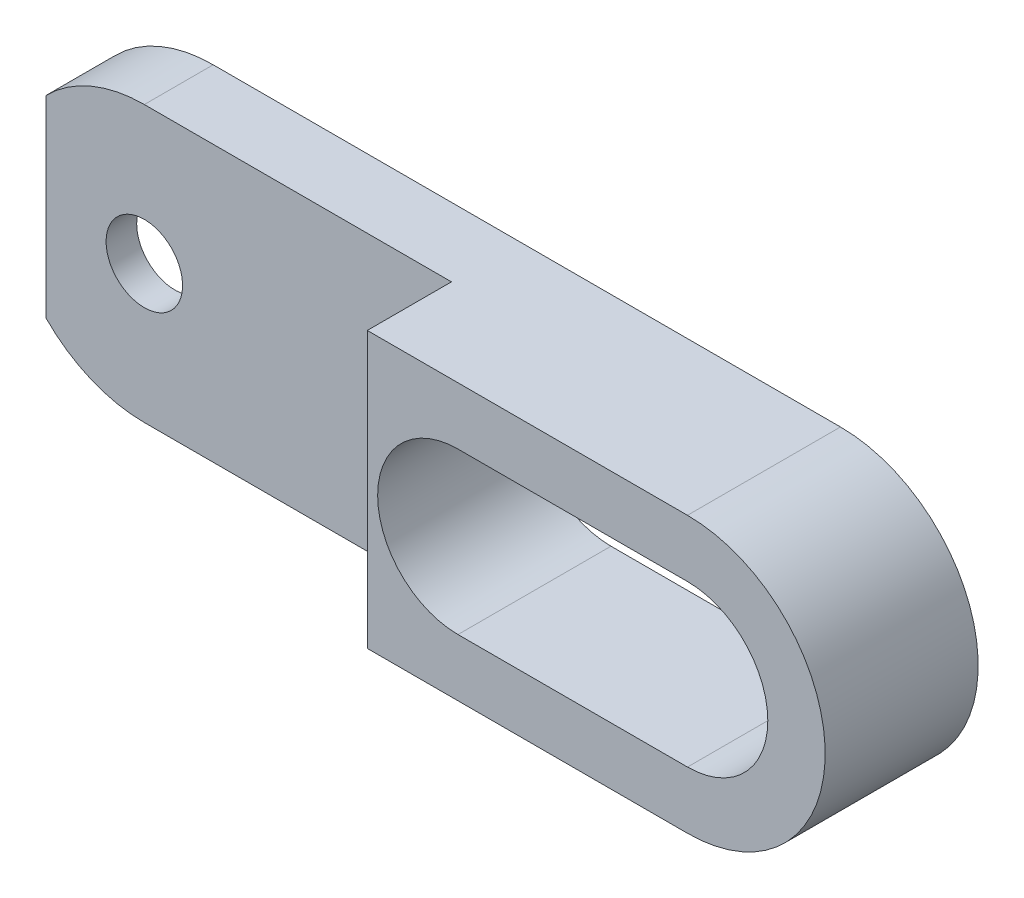
ISO-10303-21;
HEADER;
FILE_DESCRIPTION(('STEP AP214'),'2;1');
FILE_NAME('part.step','',(''),(''),'','','');
FILE_SCHEMA(('AUTOMOTIVE_DESIGN { 1 0 10303 214 1 1 1 1 }'));
ENDSEC;
DATA;
#1=APPLICATION_CONTEXT('core data for automotive mechanical design processes');
#2=APPLICATION_PROTOCOL_DEFINITION('international standard','automotive_design',2000,#1);
#3=PRODUCT_CONTEXT('',#1,'mechanical');
#4=PRODUCT('Part','Part','',(#3));
#5=PRODUCT_RELATED_PRODUCT_CATEGORY('part','',(#4));
#6=PRODUCT_DEFINITION_FORMATION('','',#4);
#7=PRODUCT_DEFINITION_CONTEXT('part definition',#1,'design');
#8=PRODUCT_DEFINITION('design','',#6,#7);
#9=PRODUCT_DEFINITION_SHAPE('','',#8);
#10=(LENGTH_UNIT() NAMED_UNIT(*) SI_UNIT(.MILLI.,.METRE.));
#11=(NAMED_UNIT(*) PLANE_ANGLE_UNIT() SI_UNIT($,.RADIAN.));
#12=(NAMED_UNIT(*) SI_UNIT($,.STERADIAN.) SOLID_ANGLE_UNIT());
#13=UNCERTAINTY_MEASURE_WITH_UNIT(LENGTH_MEASURE(1.E-05),#10,'distance_accuracy_value','');
#14=(GEOMETRIC_REPRESENTATION_CONTEXT(3) GLOBAL_UNCERTAINTY_ASSIGNED_CONTEXT((#13)) GLOBAL_UNIT_ASSIGNED_CONTEXT((#10,
#11,#12)) REPRESENTATION_CONTEXT('',''));
#15=CARTESIAN_POINT('',(0.,0.,0.));
#16=DIRECTION('',(0.,0.,1.));
#17=DIRECTION('',(1.,0.,0.));
#18=AXIS2_PLACEMENT_3D('',#15,#16,#17);
#19=CARTESIAN_POINT('',(20.073456929021,9.,2.5));
#20=DIRECTION('',(1.,0.,0.));
#21=DIRECTION('',(0.,1.,0.));
#22=AXIS2_PLACEMENT_3D('',#19,#20,#21);
#23=PLANE('',#22);
#24=DIRECTION('',(0.,-1.,0.));
#25=VECTOR('',#24,1.);
#26=CARTESIAN_POINT('',(20.073456929021,9.,4.5));
#27=LINE('',#26,#25);
#28=CARTESIAN_POINT('',(20.073456929021,9.,4.5));
#29=VERTEX_POINT('',#28);
#30=CARTESIAN_POINT('',(20.073456929021,-9.,4.5));
#31=VERTEX_POINT('',#30);
#32=EDGE_CURVE('E50',#29,#31,#27,.T.);
#33=ORIENTED_EDGE('',*,*,#32,.T.);
#34=DIRECTION('',(0.,0.,1.));
#35=VECTOR('',#34,1.);
#36=CARTESIAN_POINT('',(20.073456929021,-9.,2.5));
#37=LINE('',#36,#35);
#38=CARTESIAN_POINT('',(20.073456929021,-9.,10.));
#39=VERTEX_POINT('',#38);
#40=EDGE_CURVE('E210',#31,#39,#37,.T.);
#41=ORIENTED_EDGE('',*,*,#40,.T.);
#42=DIRECTION('',(0.,1.,0.));
#43=VECTOR('',#42,1.);
#44=CARTESIAN_POINT('',(20.073456929021,9.,10.));
#45=LINE('',#44,#43);
#46=CARTESIAN_POINT('',(20.073456929021,9.,10.));
#47=VERTEX_POINT('',#46);
#48=EDGE_CURVE('E205',#39,#47,#45,.T.);
#49=ORIENTED_EDGE('',*,*,#48,.T.);
#50=DIRECTION('',(0.,0.,1.));
#51=VECTOR('',#50,1.);
#52=CARTESIAN_POINT('',(20.073456929021,9.,2.5));
#53=LINE('',#52,#51);
#54=EDGE_CURVE('E209',#29,#47,#53,.T.);
#55=ORIENTED_EDGE('',*,*,#54,.F.);
#56=EDGE_LOOP('',(#33,#41,#49,#55));
#57=FACE_BOUND('',#56,.T.);
#58=ADVANCED_FACE('F35',(#57),#23,.F.);
#59=CARTESIAN_POINT('',(0.,0.,10.));
#60=DIRECTION('',(0.,0.,-1.));
#61=DIRECTION('',(-1.,0.,0.));
#62=AXIS2_PLACEMENT_3D('',#59,#60,#61);
#63=PLANE('',#62);
#64=DIRECTION('',(-1.,0.,0.));
#65=VECTOR('',#64,1.);
#66=CARTESIAN_POINT('',(0.,9.,10.));
#67=LINE('',#66,#65);
#68=CARTESIAN_POINT('',(41.,9.,10.));
#69=VERTEX_POINT('',#68);
#70=EDGE_CURVE('E262',#69,#47,#67,.T.);
#71=ORIENTED_EDGE('',*,*,#70,.T.);
#72=ORIENTED_EDGE('',*,*,#48,.F.);
#73=DIRECTION('',(1.,0.,0.));
#74=VECTOR('',#73,1.);
#75=CARTESIAN_POINT('',(0.,-9.,10.));
#76=LINE('',#75,#74);
#77=CARTESIAN_POINT('',(41.,-9.,10.));
#78=VERTEX_POINT('',#77);
#79=EDGE_CURVE('E257',#39,#78,#76,.T.);
#80=ORIENTED_EDGE('',*,*,#79,.T.);
#81=CARTESIAN_POINT('',(41.,0.,10.));
#82=DIRECTION('',(0.,0.,1.));
#83=DIRECTION('',(-1.,0.,0.));
#84=AXIS2_PLACEMENT_3D('',#81,#82,#83);
#85=CIRCLE('',#84,9.);
#86=EDGE_CURVE('E259',#78,#69,#85,.T.);
#87=ORIENTED_EDGE('',*,*,#86,.T.);
#88=EDGE_LOOP('',(#71,#72,#80,#87));
#89=FACE_BOUND('',#88,.T.);
#90=CARTESIAN_POINT('',(26.,0.,10.));
#91=DIRECTION('',(0.,0.,1.));
#92=DIRECTION('',(1.,0.,0.));
#93=AXIS2_PLACEMENT_3D('',#90,#91,#92);
#94=CIRCLE('',#93,5.25);
#95=CARTESIAN_POINT('',(26.,5.25,10.));
#96=VERTEX_POINT('',#95);
#97=CARTESIAN_POINT('',(26.,-5.25,10.));
#98=VERTEX_POINT('',#97);
#99=EDGE_CURVE('E228',#96,#98,#94,.T.);
#100=ORIENTED_EDGE('',*,*,#99,.F.);
#101=DIRECTION('',(-1.,0.,0.));
#102=VECTOR('',#101,1.);
#103=CARTESIAN_POINT('',(26.,5.25,10.));
#104=LINE('',#103,#102);
#105=CARTESIAN_POINT('',(41.,5.25,10.));
#106=VERTEX_POINT('',#105);
#107=EDGE_CURVE('E235',#106,#96,#104,.T.);
#108=ORIENTED_EDGE('',*,*,#107,.F.);
#109=CARTESIAN_POINT('',(41.,0.,10.));
#110=DIRECTION('',(0.,0.,1.));
#111=DIRECTION('',(-1.,0.,0.));
#112=AXIS2_PLACEMENT_3D('',#109,#110,#111);
#113=CIRCLE('',#112,5.25);
#114=CARTESIAN_POINT('',(41.,-5.25,10.));
#115=VERTEX_POINT('',#114);
#116=EDGE_CURVE('E233',#115,#106,#113,.T.);
#117=ORIENTED_EDGE('',*,*,#116,.F.);
#118=DIRECTION('',(1.,0.,0.));
#119=VECTOR('',#118,1.);
#120=CARTESIAN_POINT('',(26.,-5.25,10.));
#121=LINE('',#120,#119);
#122=EDGE_CURVE('E230',#98,#115,#121,.T.);
#123=ORIENTED_EDGE('',*,*,#122,.F.);
#124=EDGE_LOOP('',(#100,#108,#117,#123));
#125=FACE_BOUND('',#124,.T.);
#126=ADVANCED_FACE('F382',(#89,#125),#63,.F.);
#127=CARTESIAN_POINT('',(0.,0.,0.));
#128=DIRECTION('',(0.,0.,-1.));
#129=DIRECTION('',(-1.,0.,0.));
#130=AXIS2_PLACEMENT_3D('',#127,#128,#129);
#131=PLANE('',#130);
#132=CARTESIAN_POINT('',(0.,0.,0.));
#133=DIRECTION('',(0.,0.,1.));
#134=DIRECTION('',(-1.,0.,0.));
#135=AXIS2_PLACEMENT_3D('',#132,#133,#134);
#136=CIRCLE('',#135,9.);
#137=CARTESIAN_POINT('',(0.,9.,0.));
#138=VERTEX_POINT('',#137);
#139=CARTESIAN_POINT('',(-6.42654307097901,6.30075742723457,0.));
#140=VERTEX_POINT('',#139);
#141=EDGE_CURVE('E256',#138,#140,#136,.T.);
#142=ORIENTED_EDGE('',*,*,#141,.F.);
#143=DIRECTION('',(-1.,0.,0.));
#144=VECTOR('',#143,1.);
#145=CARTESIAN_POINT('',(0.,9.,0.));
#146=LINE('',#145,#144);
#147=CARTESIAN_POINT('',(41.,9.,0.));
#148=VERTEX_POINT('',#147);
#149=EDGE_CURVE('E260',#148,#138,#146,.T.);
#150=ORIENTED_EDGE('',*,*,#149,.F.);
#151=CARTESIAN_POINT('',(41.,0.,0.));
#152=DIRECTION('',(0.,0.,1.));
#153=DIRECTION('',(-1.,0.,0.));
#154=AXIS2_PLACEMENT_3D('',#151,#152,#153);
#155=CIRCLE('',#154,9.);
#156=CARTESIAN_POINT('',(41.,-9.,0.));
#157=VERTEX_POINT('',#156);
#158=EDGE_CURVE('E293',#157,#148,#155,.T.);
#159=ORIENTED_EDGE('',*,*,#158,.F.);
#160=DIRECTION('',(1.,0.,0.));
#161=VECTOR('',#160,1.);
#162=CARTESIAN_POINT('',(0.,-9.,0.));
#163=LINE('',#162,#161);
#164=CARTESIAN_POINT('',(0.,-9.,0.));
#165=VERTEX_POINT('',#164);
#166=EDGE_CURVE('E291',#165,#157,#163,.T.);
#167=ORIENTED_EDGE('',*,*,#166,.F.);
#168=CARTESIAN_POINT('',(0.,0.,0.));
#169=DIRECTION('',(0.,0.,1.));
#170=DIRECTION('',(1.,0.,0.));
#171=AXIS2_PLACEMENT_3D('',#168,#169,#170);
#172=CIRCLE('',#171,9.);
#173=CARTESIAN_POINT('',(-6.42654307097901,-6.30075742723457,0.));
#174=VERTEX_POINT('',#173);
#175=EDGE_CURVE('E289',#174,#165,#172,.T.);
#176=ORIENTED_EDGE('',*,*,#175,.F.);
#177=DIRECTION('',(-0.707106781186548,-0.707106781186548,0.));
#178=VECTOR('',#177,1.);
#179=CARTESIAN_POINT('',(-4.37578564374445,-4.25,0.));
#180=LINE('',#179,#178);
#181=CARTESIAN_POINT('',(-4.37578564374444,-4.25,0.));
#182=VERTEX_POINT('',#181);
#183=EDGE_CURVE('E286',#182,#174,#180,.T.);
#184=ORIENTED_EDGE('',*,*,#183,.F.);
#185=CARTESIAN_POINT('',(0.,0.,0.));
#186=DIRECTION('',(0.,0.,-1.));
#187=DIRECTION('',(-1.,0.,0.));
#188=AXIS2_PLACEMENT_3D('',#185,#186,#187);
#189=CIRCLE('',#188,6.1);
#190=CARTESIAN_POINT('',(4.37578564374445,-4.25,0.));
#191=VERTEX_POINT('',#190);
#192=EDGE_CURVE('E283',#191,#182,#189,.T.);
#193=ORIENTED_EDGE('',*,*,#192,.F.);
#194=DIRECTION('',(-0.993627549913592,-0.112713317991759,0.));
#195=VECTOR('',#194,1.);
#196=CARTESIAN_POINT('',(17.3155972903769,-2.78215713975806,0.));
#197=LINE('',#196,#195);
#198=CARTESIAN_POINT('',(17.3155972903769,-2.78215713975806,0.));
#199=VERTEX_POINT('',#198);
#200=EDGE_CURVE('E280',#199,#191,#197,.T.);
#201=ORIENTED_EDGE('',*,*,#200,.F.);
#202=CARTESIAN_POINT('',(17.,0.,0.));
#203=DIRECTION('',(0.,0.,-1.));
#204=DIRECTION('',(1.,0.,0.));
#205=AXIS2_PLACEMENT_3D('',#202,#203,#204);
#206=CIRCLE('',#205,2.8);
#207=CARTESIAN_POINT('',(17.3155972903769,2.78215713975806,0.));
#208=VERTEX_POINT('',#207);
#209=EDGE_CURVE('E277',#208,#199,#206,.T.);
#210=ORIENTED_EDGE('',*,*,#209,.F.);
#211=DIRECTION('',(0.993627549913592,-0.112713317991759,0.));
#212=VECTOR('',#211,1.);
#213=CARTESIAN_POINT('',(4.37578564374445,4.25,0.));
#214=LINE('',#213,#212);
#215=CARTESIAN_POINT('',(4.37578564374445,4.25,0.));
#216=VERTEX_POINT('',#215);
#217=EDGE_CURVE('E274',#216,#208,#214,.T.);
#218=ORIENTED_EDGE('',*,*,#217,.F.);
#219=CARTESIAN_POINT('',(0.,0.,0.));
#220=DIRECTION('',(0.,0.,-1.));
#221=DIRECTION('',(1.,0.,0.));
#222=AXIS2_PLACEMENT_3D('',#219,#220,#221);
#223=CIRCLE('',#222,6.1);
#224=CARTESIAN_POINT('',(-4.37578564374445,4.25,0.));
#225=VERTEX_POINT('',#224);
#226=EDGE_CURVE('E271',#225,#216,#223,.T.);
#227=ORIENTED_EDGE('',*,*,#226,.F.);
#228=DIRECTION('',(0.707106781186548,-0.707106781186548,0.));
#229=VECTOR('',#228,1.);
#230=CARTESIAN_POINT('',(-4.37578564374445,4.25,0.));
#231=LINE('',#230,#229);
#232=EDGE_CURVE('E268',#140,#225,#231,.T.);
#233=ORIENTED_EDGE('',*,*,#232,.F.);
#234=EDGE_LOOP('',(#142,#150,#159,#167,#176,#184,#193,#201,#210,#218,#227,#233));
#235=FACE_BOUND('',#234,.T.);
#236=DIRECTION('',(-1.,0.,0.));
#237=VECTOR('',#236,1.);
#238=CARTESIAN_POINT('',(26.,5.25,0.));
#239=LINE('',#238,#237);
#240=CARTESIAN_POINT('',(41.,5.25,0.));
#241=VERTEX_POINT('',#240);
#242=CARTESIAN_POINT('',(26.,5.25,0.));
#243=VERTEX_POINT('',#242);
#244=EDGE_CURVE('E231',#241,#243,#239,.T.);
#245=ORIENTED_EDGE('',*,*,#244,.T.);
#246=CARTESIAN_POINT('',(26.,0.,0.));
#247=DIRECTION('',(0.,0.,1.));
#248=DIRECTION('',(1.,0.,0.));
#249=AXIS2_PLACEMENT_3D('',#246,#247,#248);
#250=CIRCLE('',#249,5.25);
#251=CARTESIAN_POINT('',(26.,-5.25,0.));
#252=VERTEX_POINT('',#251);
#253=EDGE_CURVE('E227',#243,#252,#250,.T.);
#254=ORIENTED_EDGE('',*,*,#253,.T.);
#255=DIRECTION('',(1.,0.,0.));
#256=VECTOR('',#255,1.);
#257=CARTESIAN_POINT('',(26.,-5.25,0.));
#258=LINE('',#257,#256);
#259=CARTESIAN_POINT('',(41.,-5.25,0.));
#260=VERTEX_POINT('',#259);
#261=EDGE_CURVE('E240',#252,#260,#258,.T.);
#262=ORIENTED_EDGE('',*,*,#261,.T.);
#263=CARTESIAN_POINT('',(41.,0.,0.));
#264=DIRECTION('',(0.,0.,1.));
#265=DIRECTION('',(-1.,0.,0.));
#266=AXIS2_PLACEMENT_3D('',#263,#264,#265);
#267=CIRCLE('',#266,5.25);
#268=EDGE_CURVE('E243',#260,#241,#267,.T.);
#269=ORIENTED_EDGE('',*,*,#268,.T.);
#270=EDGE_LOOP('',(#245,#254,#262,#269));
#271=FACE_BOUND('',#270,.T.);
#272=ADVANCED_FACE('F330',(#235,#271),#131,.T.);
#273=CARTESIAN_POINT('',(0.,0.,10.));
#274=DIRECTION('',(0.,0.,-1.));
#275=DIRECTION('',(-1.,0.,0.));
#276=AXIS2_PLACEMENT_3D('',#273,#274,#275);
#277=CYLINDRICAL_SURFACE('',#276,9.);
#278=DIRECTION('',(0.,0.,-1.));
#279=VECTOR('',#278,1.);
#280=CARTESIAN_POINT('',(-6.42654307097901,6.30075742723457,10.));
#281=LINE('',#280,#279);
#282=CARTESIAN_POINT('',(-6.42654307097902,6.30075742723457,2.5));
#283=VERTEX_POINT('',#282);
#284=EDGE_CURVE('E11',#283,#140,#281,.T.);
#285=ORIENTED_EDGE('',*,*,#284,.F.);
#286=DIRECTION('',(0.,0.,-1.));
#287=VECTOR('',#286,1.);
#288=CARTESIAN_POINT('',(-6.42654307097902,6.30075742723457,4.5));
#289=LINE('',#288,#287);
#290=CARTESIAN_POINT('',(-6.42654307097902,6.30075742723457,4.5));
#291=VERTEX_POINT('',#290);
#292=EDGE_CURVE('E175',#291,#283,#289,.T.);
#293=ORIENTED_EDGE('',*,*,#292,.F.);
#294=CARTESIAN_POINT('',(0.,0.,4.5));
#295=DIRECTION('',(0.,0.,-1.));
#296=DIRECTION('',(-1.,0.,0.));
#297=AXIS2_PLACEMENT_3D('',#294,#295,#296);
#298=CIRCLE('',#297,9.);
#299=CARTESIAN_POINT('',(0.,9.,4.5));
#300=VERTEX_POINT('',#299);
#301=EDGE_CURVE('E187',#291,#300,#298,.T.);
#302=ORIENTED_EDGE('',*,*,#301,.T.);
#303=DIRECTION('',(0.,0.,-1.));
#304=VECTOR('',#303,1.);
#305=CARTESIAN_POINT('',(0.,9.,10.));
#306=LINE('',#305,#304);
#307=EDGE_CURVE('E265',#300,#138,#306,.T.);
#308=ORIENTED_EDGE('',*,*,#307,.T.);
#309=ORIENTED_EDGE('',*,*,#141,.T.);
#310=EDGE_LOOP('',(#285,#293,#302,#308,#309));
#311=FACE_BOUND('',#310,.T.);
#312=ADVANCED_FACE('F37',(#311),#277,.T.);
#313=CARTESIAN_POINT('',(-4.37578564374445,4.25,10.));
#314=DIRECTION('',(0.707106781186548,0.707106781186548,0.));
#315=DIRECTION('',(-0.707106781186548,0.707106781186548,0.));
#316=AXIS2_PLACEMENT_3D('',#313,#314,#315);
#317=PLANE('',#316);
#318=DIRECTION('',(0.,0.,-1.));
#319=VECTOR('',#318,1.);
#320=CARTESIAN_POINT('',(-4.37578564374445,4.25,10.));
#321=LINE('',#320,#319);
#322=CARTESIAN_POINT('',(-4.37578564374445,4.25,2.5));
#323=VERTEX_POINT('',#322);
#324=EDGE_CURVE('E43',#323,#225,#321,.T.);
#325=ORIENTED_EDGE('',*,*,#324,.F.);
#326=DIRECTION('',(-0.707106781186548,0.707106781186548,0.));
#327=VECTOR('',#326,1.);
#328=CARTESIAN_POINT('',(-4.37578564374445,4.25,2.5));
#329=LINE('',#328,#327);
#330=EDGE_CURVE('E225',#323,#283,#329,.T.);
#331=ORIENTED_EDGE('',*,*,#330,.T.);
#332=ORIENTED_EDGE('',*,*,#284,.T.);
#333=ORIENTED_EDGE('',*,*,#232,.T.);
#334=EDGE_LOOP('',(#325,#331,#332,#333));
#335=FACE_BOUND('',#334,.T.);
#336=ADVANCED_FACE('F326',(#335),#317,.F.);
#337=CARTESIAN_POINT('',(0.,0.,10.));
#338=DIRECTION('',(0.,0.,-1.));
#339=DIRECTION('',(-1.,0.,0.));
#340=AXIS2_PLACEMENT_3D('',#337,#338,#339);
#341=CYLINDRICAL_SURFACE('',#340,6.1);
#342=DIRECTION('',(0.,0.,-1.));
#343=VECTOR('',#342,1.);
#344=CARTESIAN_POINT('',(4.37578564374445,4.25,10.));
#345=LINE('',#344,#343);
#346=CARTESIAN_POINT('',(4.37578564374445,4.25,2.5));
#347=VERTEX_POINT('',#346);
#348=EDGE_CURVE('E315',#347,#216,#345,.T.);
#349=ORIENTED_EDGE('',*,*,#348,.F.);
#350=CARTESIAN_POINT('',(0.,0.,2.5));
#351=DIRECTION('',(0.,0.,-1.));
#352=DIRECTION('',(-1.,0.,0.));
#353=AXIS2_PLACEMENT_3D('',#350,#351,#352);
#354=CIRCLE('',#353,6.1);
#355=EDGE_CURVE('E223',#347,#323,#354,.F.);
#356=ORIENTED_EDGE('',*,*,#355,.T.);
#357=ORIENTED_EDGE('',*,*,#324,.T.);
#358=ORIENTED_EDGE('',*,*,#226,.T.);
#359=EDGE_LOOP('',(#349,#356,#357,#358));
#360=FACE_BOUND('',#359,.T.);
#361=ADVANCED_FACE('F319',(#360),#341,.F.);
#362=CARTESIAN_POINT('',(4.37578564374445,4.25,10.));
#363=DIRECTION('',(0.112713317991759,0.993627549913592,0.));
#364=DIRECTION('',(-0.993627549913592,0.112713317991759,0.));
#365=AXIS2_PLACEMENT_3D('',#362,#363,#364);
#366=PLANE('',#365);
#367=DIRECTION('',(0.,0.,-1.));
#368=VECTOR('',#367,1.);
#369=CARTESIAN_POINT('',(17.3155972903769,2.78215713975806,10.));
#370=LINE('',#369,#368);
#371=CARTESIAN_POINT('',(17.3155972903769,2.78215713975806,2.5));
#372=VERTEX_POINT('',#371);
#373=EDGE_CURVE('E313',#372,#208,#370,.T.);
#374=ORIENTED_EDGE('',*,*,#373,.F.);
#375=DIRECTION('',(-0.993627549913592,0.112713317991759,0.));
#376=VECTOR('',#375,1.);
#377=CARTESIAN_POINT('',(4.37578564374445,4.25,2.5));
#378=LINE('',#377,#376);
#379=EDGE_CURVE('E221',#372,#347,#378,.T.);
#380=ORIENTED_EDGE('',*,*,#379,.T.);
#381=ORIENTED_EDGE('',*,*,#348,.T.);
#382=ORIENTED_EDGE('',*,*,#217,.T.);
#383=EDGE_LOOP('',(#374,#380,#381,#382));
#384=FACE_BOUND('',#383,.T.);
#385=ADVANCED_FACE('F336',(#384),#366,.F.);
#386=CARTESIAN_POINT('',(17.,0.,10.));
#387=DIRECTION('',(0.,0.,-1.));
#388=DIRECTION('',(-1.,0.,0.));
#389=AXIS2_PLACEMENT_3D('',#386,#387,#388);
#390=CYLINDRICAL_SURFACE('',#389,2.8);
#391=DIRECTION('',(0.,0.,-1.));
#392=VECTOR('',#391,1.);
#393=CARTESIAN_POINT('',(17.3155972903769,-2.78215713975806,10.));
#394=LINE('',#393,#392);
#395=CARTESIAN_POINT('',(17.3155972903769,-2.78215713975806,2.5));
#396=VERTEX_POINT('',#395);
#397=EDGE_CURVE('E311',#396,#199,#394,.T.);
#398=ORIENTED_EDGE('',*,*,#397,.F.);
#399=CARTESIAN_POINT('',(17.,0.,2.5));
#400=DIRECTION('',(0.,0.,-1.));
#401=DIRECTION('',(-1.,0.,0.));
#402=AXIS2_PLACEMENT_3D('',#399,#400,#401);
#403=CIRCLE('',#402,2.8);
#404=EDGE_CURVE('E219',#396,#372,#403,.F.);
#405=ORIENTED_EDGE('',*,*,#404,.T.);
#406=ORIENTED_EDGE('',*,*,#373,.T.);
#407=ORIENTED_EDGE('',*,*,#209,.T.);
#408=EDGE_LOOP('',(#398,#405,#406,#407));
#409=FACE_BOUND('',#408,.T.);
#410=ADVANCED_FACE('F372',(#409),#390,.F.);
#411=CARTESIAN_POINT('',(17.3155972903769,-2.78215713975806,10.));
#412=DIRECTION('',(0.112713317991759,-0.993627549913592,0.));
#413=DIRECTION('',(0.993627549913592,0.112713317991759,0.));
#414=AXIS2_PLACEMENT_3D('',#411,#412,#413);
#415=PLANE('',#414);
#416=DIRECTION('',(0.,0.,-1.));
#417=VECTOR('',#416,1.);
#418=CARTESIAN_POINT('',(4.37578564374445,-4.25,10.));
#419=LINE('',#418,#417);
#420=CARTESIAN_POINT('',(4.37578564374445,-4.25,2.5));
#421=VERTEX_POINT('',#420);
#422=EDGE_CURVE('E309',#421,#191,#419,.T.);
#423=ORIENTED_EDGE('',*,*,#422,.F.);
#424=DIRECTION('',(0.993627549913592,0.112713317991759,0.));
#425=VECTOR('',#424,1.);
#426=CARTESIAN_POINT('',(17.3155972903769,-2.78215713975806,2.5));
#427=LINE('',#426,#425);
#428=EDGE_CURVE('E217',#421,#396,#427,.T.);
#429=ORIENTED_EDGE('',*,*,#428,.T.);
#430=ORIENTED_EDGE('',*,*,#397,.T.);
#431=ORIENTED_EDGE('',*,*,#200,.T.);
#432=EDGE_LOOP('',(#423,#429,#430,#431));
#433=FACE_BOUND('',#432,.T.);
#434=ADVANCED_FACE('F368',(#433),#415,.F.);
#435=CARTESIAN_POINT('',(0.,0.,10.));
#436=DIRECTION('',(0.,0.,-1.));
#437=DIRECTION('',(-1.,0.,0.));
#438=AXIS2_PLACEMENT_3D('',#435,#436,#437);
#439=CYLINDRICAL_SURFACE('',#438,6.1);
#440=DIRECTION('',(0.,0.,-1.));
#441=VECTOR('',#440,1.);
#442=CARTESIAN_POINT('',(-4.37578564374444,-4.25,10.));
#443=LINE('',#442,#441);
#444=CARTESIAN_POINT('',(-4.37578564374445,-4.25,2.5));
#445=VERTEX_POINT('',#444);
#446=EDGE_CURVE('E307',#445,#182,#443,.T.);
#447=ORIENTED_EDGE('',*,*,#446,.F.);
#448=CARTESIAN_POINT('',(0.,0.,2.5));
#449=DIRECTION('',(0.,0.,-1.));
#450=DIRECTION('',(-1.,0.,0.));
#451=AXIS2_PLACEMENT_3D('',#448,#449,#450);
#452=CIRCLE('',#451,6.1);
#453=EDGE_CURVE('E215',#445,#421,#452,.F.);
#454=ORIENTED_EDGE('',*,*,#453,.T.);
#455=ORIENTED_EDGE('',*,*,#422,.T.);
#456=ORIENTED_EDGE('',*,*,#192,.T.);
#457=EDGE_LOOP('',(#447,#454,#455,#456));
#458=FACE_BOUND('',#457,.T.);
#459=ADVANCED_FACE('F365',(#458),#439,.F.);
#460=CARTESIAN_POINT('',(-4.37578564374445,-4.25,10.));
#461=DIRECTION('',(0.707106781186548,-0.707106781186548,0.));
#462=DIRECTION('',(0.707106781186548,0.707106781186548,0.));
#463=AXIS2_PLACEMENT_3D('',#460,#461,#462);
#464=PLANE('',#463);
#465=DIRECTION('',(0.,0.,-1.));
#466=VECTOR('',#465,1.);
#467=CARTESIAN_POINT('',(-6.42654307097901,-6.30075742723457,10.));
#468=LINE('',#467,#466);
#469=CARTESIAN_POINT('',(-6.42654307097902,-6.30075742723457,2.5));
#470=VERTEX_POINT('',#469);
#471=EDGE_CURVE('E305',#470,#174,#468,.T.);
#472=ORIENTED_EDGE('',*,*,#471,.F.);
#473=DIRECTION('',(0.707106781186548,0.707106781186548,0.));
#474=VECTOR('',#473,1.);
#475=CARTESIAN_POINT('',(-4.37578564374445,-4.25,2.5));
#476=LINE('',#475,#474);
#477=EDGE_CURVE('E212',#470,#445,#476,.T.);
#478=ORIENTED_EDGE('',*,*,#477,.T.);
#479=ORIENTED_EDGE('',*,*,#446,.T.);
#480=ORIENTED_EDGE('',*,*,#183,.T.);
#481=EDGE_LOOP('',(#472,#478,#479,#480));
#482=FACE_BOUND('',#481,.T.);
#483=ADVANCED_FACE('F361',(#482),#464,.F.);
#484=CARTESIAN_POINT('',(0.,0.,10.));
#485=DIRECTION('',(0.,0.,-1.));
#486=DIRECTION('',(-1.,0.,0.));
#487=AXIS2_PLACEMENT_3D('',#484,#485,#486);
#488=CYLINDRICAL_SURFACE('',#487,9.);
#489=DIRECTION('',(0.,0.,-1.));
#490=VECTOR('',#489,1.);
#491=CARTESIAN_POINT('',(0.,-9.,10.));
#492=LINE('',#491,#490);
#493=CARTESIAN_POINT('',(0.,-9.,4.5));
#494=VERTEX_POINT('',#493);
#495=EDGE_CURVE('E191',#494,#165,#492,.T.);
#496=ORIENTED_EDGE('',*,*,#495,.F.);
#497=CARTESIAN_POINT('',(0.,0.,4.5));
#498=DIRECTION('',(0.,0.,-1.));
#499=DIRECTION('',(-1.,0.,0.));
#500=AXIS2_PLACEMENT_3D('',#497,#498,#499);
#501=CIRCLE('',#500,9.);
#502=CARTESIAN_POINT('',(-6.42654307097901,-6.30075742723457,4.5));
#503=VERTEX_POINT('',#502);
#504=EDGE_CURVE('E183',#494,#503,#501,.T.);
#505=ORIENTED_EDGE('',*,*,#504,.T.);
#506=DIRECTION('',(0.,0.,-1.));
#507=VECTOR('',#506,1.);
#508=CARTESIAN_POINT('',(-6.42654307097901,-6.30075742723457,4.5));
#509=LINE('',#508,#507);
#510=EDGE_CURVE('E166',#503,#470,#509,.T.);
#511=ORIENTED_EDGE('',*,*,#510,.T.);
#512=ORIENTED_EDGE('',*,*,#471,.T.);
#513=ORIENTED_EDGE('',*,*,#175,.T.);
#514=EDGE_LOOP('',(#496,#505,#511,#512,#513));
#515=FACE_BOUND('',#514,.T.);
#516=ADVANCED_FACE('F189',(#515),#488,.T.);
#517=CARTESIAN_POINT('',(0.,-9.,10.));
#518=DIRECTION('',(0.,1.,0.));
#519=DIRECTION('',(-1.,0.,0.));
#520=AXIS2_PLACEMENT_3D('',#517,#518,#519);
#521=PLANE('',#520);
#522=ORIENTED_EDGE('',*,*,#79,.F.);
#523=ORIENTED_EDGE('',*,*,#40,.F.);
#524=DIRECTION('',(-1.,0.,0.));
#525=VECTOR('',#524,1.);
#526=CARTESIAN_POINT('',(0.,-9.,4.5));
#527=LINE('',#526,#525);
#528=EDGE_CURVE('E176',#31,#494,#527,.T.);
#529=ORIENTED_EDGE('',*,*,#528,.T.);
#530=ORIENTED_EDGE('',*,*,#495,.T.);
#531=ORIENTED_EDGE('',*,*,#166,.T.);
#532=DIRECTION('',(0.,0.,-1.));
#533=VECTOR('',#532,1.);
#534=CARTESIAN_POINT('',(41.,-9.,10.));
#535=LINE('',#534,#533);
#536=EDGE_CURVE('E301',#78,#157,#535,.T.);
#537=ORIENTED_EDGE('',*,*,#536,.F.);
#538=EDGE_LOOP('',(#522,#523,#529,#530,#531,#537));
#539=FACE_BOUND('',#538,.T.);
#540=ADVANCED_FACE('F356',(#539),#521,.F.);
#541=CARTESIAN_POINT('',(41.,0.,10.));
#542=DIRECTION('',(0.,0.,-1.));
#543=DIRECTION('',(-1.,0.,0.));
#544=AXIS2_PLACEMENT_3D('',#541,#542,#543);
#545=CYLINDRICAL_SURFACE('',#544,9.);
#546=ORIENTED_EDGE('',*,*,#158,.T.);
#547=DIRECTION('',(0.,0.,-1.));
#548=VECTOR('',#547,1.);
#549=CARTESIAN_POINT('',(41.,9.,10.));
#550=LINE('',#549,#548);
#551=EDGE_CURVE('E298',#69,#148,#550,.T.);
#552=ORIENTED_EDGE('',*,*,#551,.F.);
#553=ORIENTED_EDGE('',*,*,#86,.F.);
#554=ORIENTED_EDGE('',*,*,#536,.T.);
#555=EDGE_LOOP('',(#546,#552,#553,#554));
#556=FACE_BOUND('',#555,.T.);
#557=ADVANCED_FACE('F352',(#556),#545,.T.);
#558=CARTESIAN_POINT('',(0.,9.,10.));
#559=DIRECTION('',(0.,-1.,0.));
#560=DIRECTION('',(1.,0.,0.));
#561=AXIS2_PLACEMENT_3D('',#558,#559,#560);
#562=PLANE('',#561);
#563=ORIENTED_EDGE('',*,*,#307,.F.);
#564=DIRECTION('',(1.,0.,0.));
#565=VECTOR('',#564,1.);
#566=CARTESIAN_POINT('',(0.,9.,4.5));
#567=LINE('',#566,#565);
#568=EDGE_CURVE('E200',#300,#29,#567,.T.);
#569=ORIENTED_EDGE('',*,*,#568,.T.);
#570=ORIENTED_EDGE('',*,*,#54,.T.);
#571=ORIENTED_EDGE('',*,*,#70,.F.);
#572=ORIENTED_EDGE('',*,*,#551,.T.);
#573=ORIENTED_EDGE('',*,*,#149,.T.);
#574=EDGE_LOOP('',(#563,#569,#570,#571,#572,#573));
#575=FACE_BOUND('',#574,.T.);
#576=ADVANCED_FACE('F347',(#575),#562,.F.);
#577=CARTESIAN_POINT('',(26.,0.,10.));
#578=DIRECTION('',(0.,0.,-1.));
#579=DIRECTION('',(-1.,0.,0.));
#580=AXIS2_PLACEMENT_3D('',#577,#578,#579);
#581=CYLINDRICAL_SURFACE('',#580,5.25);
#582=ORIENTED_EDGE('',*,*,#253,.F.);
#583=DIRECTION('',(0.,0.,-1.));
#584=VECTOR('',#583,1.);
#585=CARTESIAN_POINT('',(26.,5.25,10.));
#586=LINE('',#585,#584);
#587=EDGE_CURVE('E237',#96,#243,#586,.T.);
#588=ORIENTED_EDGE('',*,*,#587,.F.);
#589=ORIENTED_EDGE('',*,*,#99,.T.);
#590=DIRECTION('',(0.,0.,-1.));
#591=VECTOR('',#590,1.);
#592=CARTESIAN_POINT('',(26.,-5.25,10.));
#593=LINE('',#592,#591);
#594=EDGE_CURVE('E253',#98,#252,#593,.T.);
#595=ORIENTED_EDGE('',*,*,#594,.T.);
#596=EDGE_LOOP('',(#582,#588,#589,#595));
#597=FACE_BOUND('',#596,.T.);
#598=ADVANCED_FACE('F402',(#597),#581,.F.);
#599=CARTESIAN_POINT('',(26.,-5.25,10.));
#600=DIRECTION('',(0.,1.,0.));
#601=DIRECTION('',(0.,0.,1.));
#602=AXIS2_PLACEMENT_3D('',#599,#600,#601);
#603=PLANE('',#602);
#604=ORIENTED_EDGE('',*,*,#261,.F.);
#605=ORIENTED_EDGE('',*,*,#594,.F.);
#606=ORIENTED_EDGE('',*,*,#122,.T.);
#607=DIRECTION('',(0.,0.,-1.));
#608=VECTOR('',#607,1.);
#609=CARTESIAN_POINT('',(41.,-5.25,10.));
#610=LINE('',#609,#608);
#611=EDGE_CURVE('E251',#115,#260,#610,.T.);
#612=ORIENTED_EDGE('',*,*,#611,.T.);
#613=EDGE_LOOP('',(#604,#605,#606,#612));
#614=FACE_BOUND('',#613,.T.);
#615=ADVANCED_FACE('F398',(#614),#603,.T.);
#616=CARTESIAN_POINT('',(41.,0.,10.));
#617=DIRECTION('',(0.,0.,-1.));
#618=DIRECTION('',(-1.,0.,0.));
#619=AXIS2_PLACEMENT_3D('',#616,#617,#618);
#620=CYLINDRICAL_SURFACE('',#619,5.25);
#621=ORIENTED_EDGE('',*,*,#268,.F.);
#622=ORIENTED_EDGE('',*,*,#611,.F.);
#623=ORIENTED_EDGE('',*,*,#116,.T.);
#624=DIRECTION('',(0.,0.,-1.));
#625=VECTOR('',#624,1.);
#626=CARTESIAN_POINT('',(41.,5.25,10.));
#627=LINE('',#626,#625);
#628=EDGE_CURVE('E58',#106,#241,#627,.T.);
#629=ORIENTED_EDGE('',*,*,#628,.T.);
#630=EDGE_LOOP('',(#621,#622,#623,#629));
#631=FACE_BOUND('',#630,.T.);
#632=ADVANCED_FACE('F395',(#631),#620,.F.);
#633=CARTESIAN_POINT('',(26.,5.25,10.));
#634=DIRECTION('',(0.,-1.,0.));
#635=DIRECTION('',(0.,0.,-1.));
#636=AXIS2_PLACEMENT_3D('',#633,#634,#635);
#637=PLANE('',#636);
#638=ORIENTED_EDGE('',*,*,#244,.F.);
#639=ORIENTED_EDGE('',*,*,#628,.F.);
#640=ORIENTED_EDGE('',*,*,#107,.T.);
#641=ORIENTED_EDGE('',*,*,#587,.T.);
#642=EDGE_LOOP('',(#638,#639,#640,#641));
#643=FACE_BOUND('',#642,.T.);
#644=ADVANCED_FACE('F392',(#643),#637,.T.);
#645=CARTESIAN_POINT('',(0.,0.,2.5));
#646=DIRECTION('',(0.,0.,-1.));
#647=DIRECTION('',(-1.,0.,0.));
#648=AXIS2_PLACEMENT_3D('',#645,#646,#647);
#649=PLANE('',#648);
#650=CARTESIAN_POINT('',(0.,0.,2.5));
#651=DIRECTION('',(0.,0.,-1.));
#652=DIRECTION('',(-1.,0.,0.));
#653=AXIS2_PLACEMENT_3D('',#650,#651,#652);
#654=CIRCLE('',#653,2.5);
#655=CARTESIAN_POINT('',(-2.5,0.,2.5));
#656=VERTEX_POINT('',#655);
#657=EDGE_CURVE('E196',#656,#656,#654,.T.);
#658=ORIENTED_EDGE('',*,*,#657,.F.);
#659=EDGE_LOOP('',(#658));
#660=FACE_BOUND('',#659,.T.);
#661=ORIENTED_EDGE('',*,*,#330,.F.);
#662=ORIENTED_EDGE('',*,*,#355,.F.);
#663=ORIENTED_EDGE('',*,*,#379,.F.);
#664=ORIENTED_EDGE('',*,*,#404,.F.);
#665=ORIENTED_EDGE('',*,*,#428,.F.);
#666=ORIENTED_EDGE('',*,*,#453,.F.);
#667=ORIENTED_EDGE('',*,*,#477,.F.);
#668=DIRECTION('',(0.,1.,0.));
#669=VECTOR('',#668,1.);
#670=CARTESIAN_POINT('',(-6.42654307097901,-6.30075742723457,2.5));
#671=LINE('',#670,#669);
#672=EDGE_CURVE('E172',#470,#283,#671,.T.);
#673=ORIENTED_EDGE('',*,*,#672,.T.);
#674=EDGE_LOOP('',(#661,#662,#663,#664,#665,#666,#667,#673));
#675=FACE_BOUND('',#674,.T.);
#676=ADVANCED_FACE('F339',(#660,#675),#649,.T.);
#677=CARTESIAN_POINT('',(-6.42654307097901,-6.30075742723457,4.5));
#678=DIRECTION('',(-1.,0.,0.));
#679=DIRECTION('',(0.,0.,1.));
#680=AXIS2_PLACEMENT_3D('',#677,#678,#679);
#681=PLANE('',#680);
#682=ORIENTED_EDGE('',*,*,#672,.F.);
#683=ORIENTED_EDGE('',*,*,#510,.F.);
#684=DIRECTION('',(0.,1.,0.));
#685=VECTOR('',#684,1.);
#686=CARTESIAN_POINT('',(-6.42654307097901,-6.30075742723457,4.5));
#687=LINE('',#686,#685);
#688=EDGE_CURVE('E170',#503,#291,#687,.T.);
#689=ORIENTED_EDGE('',*,*,#688,.T.);
#690=ORIENTED_EDGE('',*,*,#292,.T.);
#691=EDGE_LOOP('',(#682,#683,#689,#690));
#692=FACE_BOUND('',#691,.T.);
#693=ADVANCED_FACE('F168',(#692),#681,.T.);
#694=CARTESIAN_POINT('',(0.,0.,4.5));
#695=DIRECTION('',(0.,0.,-1.));
#696=DIRECTION('',(-1.,0.,0.));
#697=AXIS2_PLACEMENT_3D('',#694,#695,#696);
#698=PLANE('',#697);
#699=CARTESIAN_POINT('',(0.,0.,4.5));
#700=DIRECTION('',(0.,0.,-1.));
#701=DIRECTION('',(-1.,0.,0.));
#702=AXIS2_PLACEMENT_3D('',#699,#700,#701);
#703=CIRCLE('',#702,2.5);
#704=CARTESIAN_POINT('',(-2.5,0.,4.5));
#705=VERTEX_POINT('',#704);
#706=EDGE_CURVE('E193',#705,#705,#703,.T.);
#707=ORIENTED_EDGE('',*,*,#706,.T.);
#708=EDGE_LOOP('',(#707));
#709=FACE_BOUND('',#708,.T.);
#710=ORIENTED_EDGE('',*,*,#504,.F.);
#711=ORIENTED_EDGE('',*,*,#528,.F.);
#712=ORIENTED_EDGE('',*,*,#32,.F.);
#713=ORIENTED_EDGE('',*,*,#568,.F.);
#714=ORIENTED_EDGE('',*,*,#301,.F.);
#715=ORIENTED_EDGE('',*,*,#688,.F.);
#716=EDGE_LOOP('',(#710,#711,#712,#713,#714,#715));
#717=FACE_BOUND('',#716,.T.);
#718=ADVANCED_FACE('F181',(#709,#717),#698,.F.);
#719=CARTESIAN_POINT('',(0.,0.,4.5));
#720=DIRECTION('',(0.,0.,-1.));
#721=DIRECTION('',(-1.,0.,0.));
#722=AXIS2_PLACEMENT_3D('',#719,#720,#721);
#723=CYLINDRICAL_SURFACE('',#722,2.5);
#724=ORIENTED_EDGE('',*,*,#706,.F.);
#725=EDGE_LOOP('',(#724));
#726=FACE_BOUND('',#725,.T.);
#727=ORIENTED_EDGE('',*,*,#657,.T.);
#728=EDGE_LOOP('',(#727));
#729=FACE_BOUND('',#728,.T.);
#730=ADVANCED_FACE('F479',(#726,#729),#723,.F.);
#731=CLOSED_SHELL('',(#58,#126,#272,#312,#336,#361,#385,#410,#434,#459,#483,#516,#540,#557,#576,
#598,#615,#632,#644,#676,#693,#718,#730));
#732=MANIFOLD_SOLID_BREP('B2',#731);
#733=ADVANCED_BREP_SHAPE_REPRESENTATION('',(#18,#732),#14);
#734=SHAPE_DEFINITION_REPRESENTATION(#9,#733);
ENDSEC;
END-ISO-10303-21;
